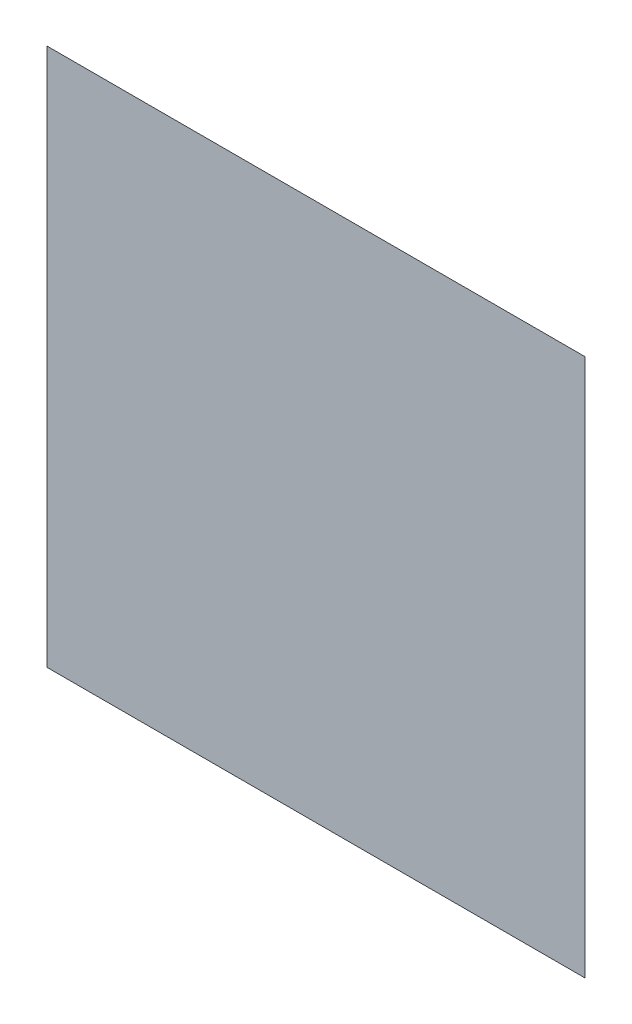
ISO-10303-21;
HEADER;
FILE_DESCRIPTION(('STEP AP214'),'2;1');
FILE_NAME('part.step','',(''),(''),'','','');
FILE_SCHEMA(('AUTOMOTIVE_DESIGN { 1 0 10303 214 1 1 1 1 }'));
ENDSEC;
DATA;
#1=APPLICATION_CONTEXT('core data for automotive mechanical design processes');
#2=APPLICATION_PROTOCOL_DEFINITION('international standard','automotive_design',2000,#1);
#3=PRODUCT_CONTEXT('',#1,'mechanical');
#4=PRODUCT('Part','Part','',(#3));
#5=PRODUCT_RELATED_PRODUCT_CATEGORY('part','',(#4));
#6=PRODUCT_DEFINITION_FORMATION('','',#4);
#7=PRODUCT_DEFINITION_CONTEXT('part definition',#1,'design');
#8=PRODUCT_DEFINITION('design','',#6,#7);
#9=PRODUCT_DEFINITION_SHAPE('','',#8);
#10=(LENGTH_UNIT() NAMED_UNIT(*) SI_UNIT(.MILLI.,.METRE.));
#11=(NAMED_UNIT(*) PLANE_ANGLE_UNIT() SI_UNIT($,.RADIAN.));
#12=(NAMED_UNIT(*) SI_UNIT($,.STERADIAN.) SOLID_ANGLE_UNIT());
#13=UNCERTAINTY_MEASURE_WITH_UNIT(LENGTH_MEASURE(1.E-05),#10,'distance_accuracy_value','');
#14=(GEOMETRIC_REPRESENTATION_CONTEXT(3) GLOBAL_UNCERTAINTY_ASSIGNED_CONTEXT((#13)) GLOBAL_UNIT_ASSIGNED_CONTEXT((#10,
#11,#12)) REPRESENTATION_CONTEXT('',''));
#15=CARTESIAN_POINT('',(0.,0.,0.));
#16=DIRECTION('',(0.,0.,1.));
#17=DIRECTION('',(1.,0.,0.));
#18=AXIS2_PLACEMENT_3D('',#15,#16,#17);
#19=CARTESIAN_POINT('',(0.,203.,1.));
#20=DIRECTION('',(0.,0.,-1.));
#21=DIRECTION('',(-1.,0.,0.));
#22=AXIS2_PLACEMENT_3D('',#19,#20,#21);
#23=PLANE('',#22);
#24=DIRECTION('',(0.,-1.,0.));
#25=VECTOR('',#24,1.);
#26=CARTESIAN_POINT('',(0.,0.,1.));
#27=LINE('',#26,#25);
#28=CARTESIAN_POINT('',(0.,203.,1.));
#29=VERTEX_POINT('',#28);
#30=CARTESIAN_POINT('',(0.,0.,1.));
#31=VERTEX_POINT('',#30);
#32=EDGE_CURVE('E84',#29,#31,#27,.T.);
#33=ORIENTED_EDGE('',*,*,#32,.T.);
#34=DIRECTION('',(1.,0.,0.));
#35=VECTOR('',#34,1.);
#36=CARTESIAN_POINT('',(0.,0.,1.));
#37=LINE('',#36,#35);
#38=CARTESIAN_POINT('',(203.,0.,1.));
#39=VERTEX_POINT('',#38);
#40=EDGE_CURVE('E87',#31,#39,#37,.T.);
#41=ORIENTED_EDGE('',*,*,#40,.T.);
#42=DIRECTION('',(0.,1.,0.));
#43=VECTOR('',#42,1.);
#44=CARTESIAN_POINT('',(203.,0.,1.));
#45=LINE('',#44,#43);
#46=CARTESIAN_POINT('',(203.,203.,1.));
#47=VERTEX_POINT('',#46);
#48=EDGE_CURVE('E108',#39,#47,#45,.T.);
#49=ORIENTED_EDGE('',*,*,#48,.T.);
#50=DIRECTION('',(-1.,0.,0.));
#51=VECTOR('',#50,1.);
#52=CARTESIAN_POINT('',(0.,203.,1.));
#53=LINE('',#52,#51);
#54=EDGE_CURVE('E89',#47,#29,#53,.T.);
#55=ORIENTED_EDGE('',*,*,#54,.T.);
#56=EDGE_LOOP('',(#33,#41,#49,#55));
#57=FACE_BOUND('',#56,.T.);
#58=ADVANCED_FACE('F32',(#57),#23,.F.);
#59=CARTESIAN_POINT('',(0.,203.,0.));
#60=DIRECTION('',(0.,0.,-1.));
#61=DIRECTION('',(-1.,0.,0.));
#62=AXIS2_PLACEMENT_3D('',#59,#60,#61);
#63=PLANE('',#62);
#64=DIRECTION('',(-1.,0.,0.));
#65=VECTOR('',#64,1.);
#66=CARTESIAN_POINT('',(203.,194.111805582684,0.));
#67=LINE('',#66,#65);
#68=CARTESIAN_POINT('',(40.,194.111805582684,0.));
#69=VERTEX_POINT('',#68);
#70=CARTESIAN_POINT('',(194.111805582684,194.111805582684,0.));
#71=VERTEX_POINT('',#70);
#72=EDGE_CURVE('E52',#69,#71,#67,.F.);
#73=ORIENTED_EDGE('',*,*,#72,.T.);
#74=DIRECTION('',(0.,1.,0.));
#75=VECTOR('',#74,1.);
#76=CARTESIAN_POINT('',(194.111805582684,0.,0.));
#77=LINE('',#76,#75);
#78=CARTESIAN_POINT('',(194.111805582684,163.,0.));
#79=VERTEX_POINT('',#78);
#80=EDGE_CURVE('E11',#71,#79,#77,.F.);
#81=ORIENTED_EDGE('',*,*,#80,.T.);
#82=DIRECTION('',(0.,1.,0.));
#83=VECTOR('',#82,1.);
#84=CARTESIAN_POINT('',(194.111805582684,0.,0.));
#85=LINE('',#84,#83);
#86=CARTESIAN_POINT('',(194.111805582684,8.88819441731559,0.));
#87=VERTEX_POINT('',#86);
#88=EDGE_CURVE('E41',#79,#87,#85,.F.);
#89=ORIENTED_EDGE('',*,*,#88,.T.);
#90=DIRECTION('',(1.,0.,0.));
#91=VECTOR('',#90,1.);
#92=CARTESIAN_POINT('',(0.,8.88819441731559,0.));
#93=LINE('',#92,#91);
#94=CARTESIAN_POINT('',(163.,8.88819441731559,0.));
#95=VERTEX_POINT('',#94);
#96=EDGE_CURVE('E120',#87,#95,#93,.F.);
#97=ORIENTED_EDGE('',*,*,#96,.T.);
#98=DIRECTION('',(1.,0.,0.));
#99=VECTOR('',#98,1.);
#100=CARTESIAN_POINT('',(0.,8.88819441731559,0.));
#101=LINE('',#100,#99);
#102=CARTESIAN_POINT('',(40.,8.88819441731559,0.));
#103=VERTEX_POINT('',#102);
#104=EDGE_CURVE('E118',#95,#103,#101,.F.);
#105=ORIENTED_EDGE('',*,*,#104,.T.);
#106=DIRECTION('',(1.,0.,0.));
#107=VECTOR('',#106,1.);
#108=CARTESIAN_POINT('',(0.,8.88819441731559,0.));
#109=LINE('',#108,#107);
#110=CARTESIAN_POINT('',(8.88819441731559,8.88819441731559,0.));
#111=VERTEX_POINT('',#110);
#112=EDGE_CURVE('E116',#103,#111,#109,.F.);
#113=ORIENTED_EDGE('',*,*,#112,.T.);
#114=DIRECTION('',(0.,-1.,0.));
#115=VECTOR('',#114,1.);
#116=CARTESIAN_POINT('',(8.88819441731559,203.,0.));
#117=LINE('',#116,#115);
#118=CARTESIAN_POINT('',(8.88819441731559,194.111805582684,0.));
#119=VERTEX_POINT('',#118);
#120=EDGE_CURVE('E98',#111,#119,#117,.F.);
#121=ORIENTED_EDGE('',*,*,#120,.T.);
#122=DIRECTION('',(-1.,0.,0.));
#123=VECTOR('',#122,1.);
#124=CARTESIAN_POINT('',(203.,194.111805582684,0.));
#125=LINE('',#124,#123);
#126=EDGE_CURVE('E114',#119,#69,#125,.F.);
#127=ORIENTED_EDGE('',*,*,#126,.T.);
#128=EDGE_LOOP('',(#73,#81,#89,#97,#105,#113,#121,#127));
#129=FACE_BOUND('',#128,.T.);
#130=ADVANCED_FACE('F129',(#129),#63,.T.);
#131=CARTESIAN_POINT('',(0.,194.111805582684,40.));
#132=DIRECTION('',(1.,0.,0.));
#133=DIRECTION('',(0.,0.,-1.));
#134=AXIS2_PLACEMENT_3D('',#131,#132,#133);
#135=CYLINDRICAL_SURFACE('',#134,40.);
#136=ORIENTED_EDGE('',*,*,#72,.F.);
#137=ORIENTED_EDGE('',*,*,#126,.F.);
#138=CARTESIAN_POINT('',(8.88819441731559,194.111805582684,40.));
#139=DIRECTION('',(0.707106781186547,0.707106781186547,0.));
#140=DIRECTION('',(-0.707106781186547,0.707106781186547,0.));
#141=AXIS2_PLACEMENT_3D('',#138,#139,#140);
#142=ELLIPSE('',#141,56.5685424949238,40.);
#143=EDGE_CURVE('E36',#29,#119,#142,.F.);
#144=ORIENTED_EDGE('',*,*,#143,.F.);
#145=ORIENTED_EDGE('',*,*,#54,.F.);
#146=CARTESIAN_POINT('',(194.111805582684,194.111805582684,40.));
#147=DIRECTION('',(0.707106781186547,-0.707106781186547,0.));
#148=DIRECTION('',(0.707106781186547,0.707106781186547,0.));
#149=AXIS2_PLACEMENT_3D('',#146,#147,#148);
#150=ELLIPSE('',#149,56.5685424949238,40.);
#151=EDGE_CURVE('E101',#71,#47,#150,.T.);
#152=ORIENTED_EDGE('',*,*,#151,.F.);
#153=EDGE_LOOP('',(#136,#137,#144,#145,#152));
#154=FACE_BOUND('',#153,.T.);
#155=ADVANCED_FACE('F34',(#154),#135,.T.);
#156=CARTESIAN_POINT('',(8.88819441731559,0.,40.));
#157=DIRECTION('',(0.,1.,0.));
#158=DIRECTION('',(0.,0.,1.));
#159=AXIS2_PLACEMENT_3D('',#156,#157,#158);
#160=CYLINDRICAL_SURFACE('',#159,40.);
#161=ORIENTED_EDGE('',*,*,#143,.T.);
#162=ORIENTED_EDGE('',*,*,#120,.F.);
#163=CARTESIAN_POINT('',(8.88819441731559,8.88819441731559,40.));
#164=DIRECTION('',(-0.707106781186547,0.707106781186547,0.));
#165=DIRECTION('',(0.707106781186547,0.707106781186547,0.));
#166=AXIS2_PLACEMENT_3D('',#163,#164,#165);
#167=ELLIPSE('',#166,56.5685424949238,40.);
#168=EDGE_CURVE('E96',#31,#111,#167,.F.);
#169=ORIENTED_EDGE('',*,*,#168,.F.);
#170=ORIENTED_EDGE('',*,*,#32,.F.);
#171=EDGE_LOOP('',(#161,#162,#169,#170));
#172=FACE_BOUND('',#171,.T.);
#173=ADVANCED_FACE('F97',(#172),#160,.T.);
#174=CARTESIAN_POINT('',(194.111805582684,0.,40.));
#175=DIRECTION('',(0.,-1.,0.));
#176=DIRECTION('',(0.,0.,-1.));
#177=AXIS2_PLACEMENT_3D('',#174,#175,#176);
#178=CYLINDRICAL_SURFACE('',#177,40.);
#179=ORIENTED_EDGE('',*,*,#151,.T.);
#180=ORIENTED_EDGE('',*,*,#48,.F.);
#181=CARTESIAN_POINT('',(194.111805582684,8.88819441731559,40.));
#182=DIRECTION('',(-0.707106781186547,-0.707106781186547,0.));
#183=DIRECTION('',(0.707106781186547,-0.707106781186547,0.));
#184=AXIS2_PLACEMENT_3D('',#181,#182,#183);
#185=ELLIPSE('',#184,56.5685424949238,40.);
#186=EDGE_CURVE('E102',#87,#39,#185,.T.);
#187=ORIENTED_EDGE('',*,*,#186,.F.);
#188=ORIENTED_EDGE('',*,*,#88,.F.);
#189=ORIENTED_EDGE('',*,*,#80,.F.);
#190=EDGE_LOOP('',(#179,#180,#187,#188,#189));
#191=FACE_BOUND('',#190,.T.);
#192=ADVANCED_FACE('F130',(#191),#178,.T.);
#193=CARTESIAN_POINT('',(0.,8.88819441731559,40.));
#194=DIRECTION('',(-1.,0.,0.));
#195=DIRECTION('',(0.,0.,1.));
#196=AXIS2_PLACEMENT_3D('',#193,#194,#195);
#197=CYLINDRICAL_SURFACE('',#196,40.);
#198=ORIENTED_EDGE('',*,*,#104,.F.);
#199=ORIENTED_EDGE('',*,*,#96,.F.);
#200=ORIENTED_EDGE('',*,*,#186,.T.);
#201=ORIENTED_EDGE('',*,*,#40,.F.);
#202=ORIENTED_EDGE('',*,*,#168,.T.);
#203=ORIENTED_EDGE('',*,*,#112,.F.);
#204=EDGE_LOOP('',(#198,#199,#200,#201,#202,#203));
#205=FACE_BOUND('',#204,.T.);
#206=ADVANCED_FACE('F104',(#205),#197,.T.);
#207=CLOSED_SHELL('',(#58,#130,#155,#173,#192,#206));
#208=MANIFOLD_SOLID_BREP('B2',#207);
#209=ADVANCED_BREP_SHAPE_REPRESENTATION('',(#18,#208),#14);
#210=SHAPE_DEFINITION_REPRESENTATION(#9,#209);
ENDSEC;
END-ISO-10303-21;
